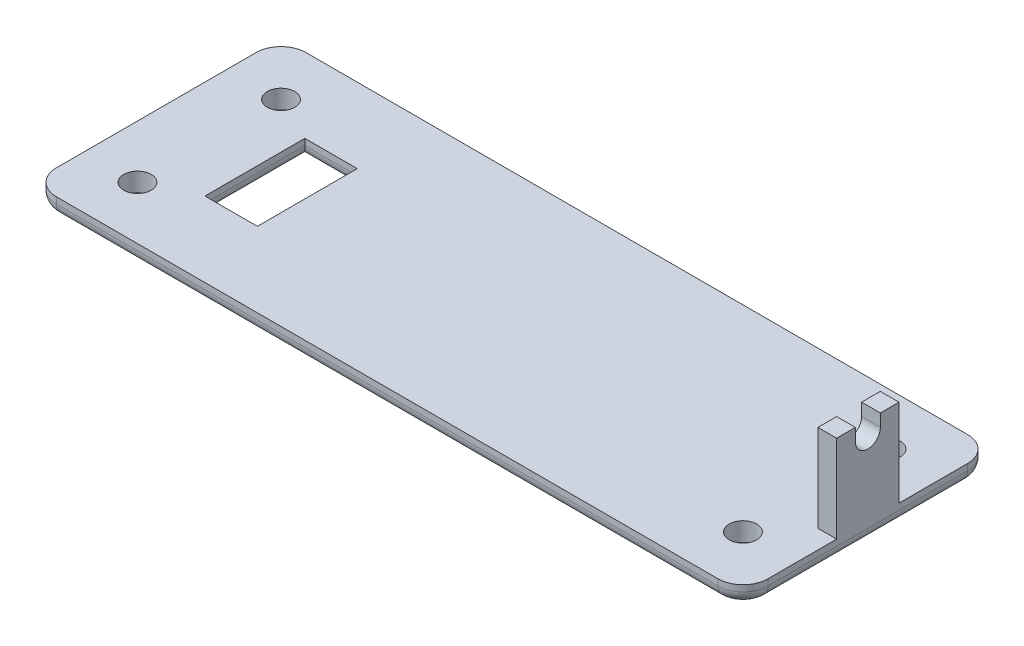
ISO-10303-21;
HEADER;
FILE_DESCRIPTION(('STEP AP214'),'2;1');
FILE_NAME('part.step','',(''),(''),'','','');
FILE_SCHEMA(('AUTOMOTIVE_DESIGN { 1 0 10303 214 1 1 1 1 }'));
ENDSEC;
DATA;
#1=APPLICATION_CONTEXT('core data for automotive mechanical design processes');
#2=APPLICATION_PROTOCOL_DEFINITION('international standard','automotive_design',2000,#1);
#3=PRODUCT_CONTEXT('',#1,'mechanical');
#4=PRODUCT('Part','Part','',(#3));
#5=PRODUCT_RELATED_PRODUCT_CATEGORY('part','',(#4));
#6=PRODUCT_DEFINITION_FORMATION('','',#4);
#7=PRODUCT_DEFINITION_CONTEXT('part definition',#1,'design');
#8=PRODUCT_DEFINITION('design','',#6,#7);
#9=PRODUCT_DEFINITION_SHAPE('','',#8);
#10=(LENGTH_UNIT() NAMED_UNIT(*) SI_UNIT(.MILLI.,.METRE.));
#11=(NAMED_UNIT(*) PLANE_ANGLE_UNIT() SI_UNIT($,.RADIAN.));
#12=(NAMED_UNIT(*) SI_UNIT($,.STERADIAN.) SOLID_ANGLE_UNIT());
#13=UNCERTAINTY_MEASURE_WITH_UNIT(LENGTH_MEASURE(1.E-05),#10,'distance_accuracy_value','');
#14=(GEOMETRIC_REPRESENTATION_CONTEXT(3) GLOBAL_UNCERTAINTY_ASSIGNED_CONTEXT((#13)) GLOBAL_UNIT_ASSIGNED_CONTEXT((#10,
#11,#12)) REPRESENTATION_CONTEXT('',''));
#15=CARTESIAN_POINT('',(0.,0.,0.));
#16=DIRECTION('',(0.,0.,1.));
#17=DIRECTION('',(1.,0.,0.));
#18=AXIS2_PLACEMENT_3D('',#15,#16,#17);
#19=CARTESIAN_POINT('',(0.,21.59,0.));
#20=DIRECTION('',(0.,-1.,0.));
#21=DIRECTION('',(0.,0.,-1.));
#22=AXIS2_PLACEMENT_3D('',#19,#20,#21);
#23=PLANE('',#22);
#24=DIRECTION('',(0.,0.,-1.));
#25=VECTOR('',#24,1.);
#26=CARTESIAN_POINT('',(72.39,21.59,-6.35000000000002));
#27=LINE('',#26,#25);
#28=CARTESIAN_POINT('',(72.39,21.59,6.34999999999998));
#29=VERTEX_POINT('',#28);
#30=CARTESIAN_POINT('',(72.39,21.59,2.54));
#31=VERTEX_POINT('',#30);
#32=EDGE_CURVE('E265',#29,#31,#27,.T.);
#33=ORIENTED_EDGE('',*,*,#32,.T.);
#34=DIRECTION('',(1.,0.,0.));
#35=VECTOR('',#34,1.);
#36=CARTESIAN_POINT('',(-72.391,21.59,2.54));
#37=LINE('',#36,#35);
#38=CARTESIAN_POINT('',(68.58,21.59,2.54));
#39=VERTEX_POINT('',#38);
#40=EDGE_CURVE('E253',#39,#31,#37,.T.);
#41=ORIENTED_EDGE('',*,*,#40,.F.);
#42=DIRECTION('',(0.,0.,1.));
#43=VECTOR('',#42,1.);
#44=CARTESIAN_POINT('',(68.58,21.59,-6.35000000000002));
#45=LINE('',#44,#43);
#46=CARTESIAN_POINT('',(68.58,21.59,6.34999999999998));
#47=VERTEX_POINT('',#46);
#48=EDGE_CURVE('E271',#39,#47,#45,.T.);
#49=ORIENTED_EDGE('',*,*,#48,.T.);
#50=DIRECTION('',(1.,0.,0.));
#51=VECTOR('',#50,1.);
#52=CARTESIAN_POINT('',(72.39,21.59,6.34999999999998));
#53=LINE('',#52,#51);
#54=EDGE_CURVE('E275',#47,#29,#53,.T.);
#55=ORIENTED_EDGE('',*,*,#54,.T.);
#56=EDGE_LOOP('',(#33,#41,#49,#55));
#57=FACE_BOUND('',#56,.T.);
#58=ADVANCED_FACE('F41',(#57),#23,.F.);
#59=CARTESIAN_POINT('',(0.,3.81,0.));
#60=DIRECTION('',(0.,-1.,0.));
#61=DIRECTION('',(0.,0.,-1.));
#62=AXIS2_PLACEMENT_3D('',#59,#60,#61);
#63=PLANE('',#62);
#64=CARTESIAN_POINT('',(-61.595,3.81,-14.605));
#65=DIRECTION('',(0.,-1.,0.));
#66=DIRECTION('',(0.,0.,-1.));
#67=AXIS2_PLACEMENT_3D('',#64,#65,#66);
#68=CIRCLE('',#67,2.794);
#69=CARTESIAN_POINT('',(-61.595,3.81,-17.399));
#70=VERTEX_POINT('',#69);
#71=EDGE_CURVE('E229',#70,#70,#68,.T.);
#72=ORIENTED_EDGE('',*,*,#71,.T.);
#73=EDGE_LOOP('',(#72));
#74=FACE_BOUND('',#73,.T.);
#75=CARTESIAN_POINT('',(-61.595,3.81,14.605));
#76=DIRECTION('',(0.,-1.,0.));
#77=DIRECTION('',(0.,0.,-1.));
#78=AXIS2_PLACEMENT_3D('',#75,#76,#77);
#79=CIRCLE('',#78,2.794);
#80=CARTESIAN_POINT('',(-61.595,3.81,11.811));
#81=VERTEX_POINT('',#80);
#82=EDGE_CURVE('E851',#81,#81,#79,.T.);
#83=ORIENTED_EDGE('',*,*,#82,.T.);
#84=EDGE_LOOP('',(#83));
#85=FACE_BOUND('',#84,.T.);
#86=CARTESIAN_POINT('',(61.595,3.81,14.605));
#87=DIRECTION('',(0.,-1.,0.));
#88=DIRECTION('',(0.,0.,-1.));
#89=AXIS2_PLACEMENT_3D('',#86,#87,#88);
#90=CIRCLE('',#89,2.79400000000001);
#91=CARTESIAN_POINT('',(61.595,3.81,11.811));
#92=VERTEX_POINT('',#91);
#93=EDGE_CURVE('E848',#92,#92,#90,.T.);
#94=ORIENTED_EDGE('',*,*,#93,.T.);
#95=EDGE_LOOP('',(#94));
#96=FACE_BOUND('',#95,.T.);
#97=CARTESIAN_POINT('',(61.595,3.81,-14.605));
#98=DIRECTION('',(0.,-1.,0.));
#99=DIRECTION('',(0.,0.,-1.));
#100=AXIS2_PLACEMENT_3D('',#97,#98,#99);
#101=CIRCLE('',#100,2.79400000000001);
#102=CARTESIAN_POINT('',(61.595,3.81,-17.399));
#103=VERTEX_POINT('',#102);
#104=EDGE_CURVE('E846',#103,#103,#101,.T.);
#105=ORIENTED_EDGE('',*,*,#104,.T.);
#106=EDGE_LOOP('',(#105));
#107=FACE_BOUND('',#106,.T.);
#108=DIRECTION('',(-1.,0.,0.));
#109=VECTOR('',#108,1.);
#110=CARTESIAN_POINT('',(0.,3.81,10.16));
#111=LINE('',#110,#109);
#112=CARTESIAN_POINT('',(-41.642,3.81,10.16));
#113=VERTEX_POINT('',#112);
#114=CARTESIAN_POINT('',(-52.31,3.81,10.16));
#115=VERTEX_POINT('',#114);
#116=EDGE_CURVE('E234',#113,#115,#111,.T.);
#117=ORIENTED_EDGE('',*,*,#116,.T.);
#118=DIRECTION('',(0.,0.,-1.));
#119=VECTOR('',#118,1.);
#120=CARTESIAN_POINT('',(-52.31,3.81,0.));
#121=LINE('',#120,#119);
#122=CARTESIAN_POINT('',(-52.31,3.81,-10.16));
#123=VERTEX_POINT('',#122);
#124=EDGE_CURVE('E227',#115,#123,#121,.T.);
#125=ORIENTED_EDGE('',*,*,#124,.T.);
#126=DIRECTION('',(1.,0.,0.));
#127=VECTOR('',#126,1.);
#128=CARTESIAN_POINT('',(0.,3.81,-10.16));
#129=LINE('',#128,#127);
#130=CARTESIAN_POINT('',(-41.642,3.81,-10.16));
#131=VERTEX_POINT('',#130);
#132=EDGE_CURVE('E215',#123,#131,#129,.T.);
#133=ORIENTED_EDGE('',*,*,#132,.T.);
#134=DIRECTION('',(0.,0.,1.));
#135=VECTOR('',#134,1.);
#136=CARTESIAN_POINT('',(-41.642,3.81,0.));
#137=LINE('',#136,#135);
#138=EDGE_CURVE('E223',#131,#113,#137,.T.);
#139=ORIENTED_EDGE('',*,*,#138,.T.);
#140=EDGE_LOOP('',(#117,#125,#133,#139));
#141=FACE_BOUND('',#140,.T.);
#142=DIRECTION('',(-1.,0.,0.));
#143=VECTOR('',#142,1.);
#144=CARTESIAN_POINT('',(-72.39,3.81,-25.4));
#145=LINE('',#144,#143);
#146=CARTESIAN_POINT('',(67.31,3.81,-25.4));
#147=VERTEX_POINT('',#146);
#148=CARTESIAN_POINT('',(-67.31,3.81,-25.4));
#149=VERTEX_POINT('',#148);
#150=EDGE_CURVE('E300',#147,#149,#145,.T.);
#151=ORIENTED_EDGE('',*,*,#150,.T.);
#152=CARTESIAN_POINT('',(-67.31,3.81,-20.32));
#153=DIRECTION('',(0.,-1.,0.));
#154=DIRECTION('',(0.,0.,-1.));
#155=AXIS2_PLACEMENT_3D('',#152,#153,#154);
#156=CIRCLE('',#155,5.08);
#157=CARTESIAN_POINT('',(-72.39,3.81,-20.32));
#158=VERTEX_POINT('',#157);
#159=EDGE_CURVE('E325',#149,#158,#156,.F.);
#160=ORIENTED_EDGE('',*,*,#159,.T.);
#161=DIRECTION('',(0.,0.,1.));
#162=VECTOR('',#161,1.);
#163=CARTESIAN_POINT('',(-72.39,3.81,25.4));
#164=LINE('',#163,#162);
#165=CARTESIAN_POINT('',(-72.39,3.81,20.32));
#166=VERTEX_POINT('',#165);
#167=EDGE_CURVE('E303',#158,#166,#164,.T.);
#168=ORIENTED_EDGE('',*,*,#167,.T.);
#169=CARTESIAN_POINT('',(-67.31,3.81,20.32));
#170=DIRECTION('',(0.,-1.,0.));
#171=DIRECTION('',(0.,0.,-1.));
#172=AXIS2_PLACEMENT_3D('',#169,#170,#171);
#173=CIRCLE('',#172,5.08);
#174=CARTESIAN_POINT('',(-67.31,3.81,25.4));
#175=VERTEX_POINT('',#174);
#176=EDGE_CURVE('E323',#166,#175,#173,.F.);
#177=ORIENTED_EDGE('',*,*,#176,.T.);
#178=DIRECTION('',(1.,0.,0.));
#179=VECTOR('',#178,1.);
#180=CARTESIAN_POINT('',(-72.39,3.81,25.4));
#181=LINE('',#180,#179);
#182=CARTESIAN_POINT('',(67.31,3.81,25.4));
#183=VERTEX_POINT('',#182);
#184=EDGE_CURVE('E306',#175,#183,#181,.T.);
#185=ORIENTED_EDGE('',*,*,#184,.T.);
#186=CARTESIAN_POINT('',(67.31,3.81,20.32));
#187=DIRECTION('',(0.,-1.,0.));
#188=DIRECTION('',(0.,0.,-1.));
#189=AXIS2_PLACEMENT_3D('',#186,#187,#188);
#190=CIRCLE('',#189,5.08);
#191=CARTESIAN_POINT('',(72.39,3.81,20.32));
#192=VERTEX_POINT('',#191);
#193=EDGE_CURVE('E321',#183,#192,#190,.F.);
#194=ORIENTED_EDGE('',*,*,#193,.T.);
#195=DIRECTION('',(0.,0.,-1.));
#196=VECTOR('',#195,1.);
#197=CARTESIAN_POINT('',(72.39,3.81,25.4));
#198=LINE('',#197,#196);
#199=CARTESIAN_POINT('',(72.39,3.81,6.34999999999998));
#200=VERTEX_POINT('',#199);
#201=EDGE_CURVE('E298',#192,#200,#198,.T.);
#202=ORIENTED_EDGE('',*,*,#201,.T.);
#203=DIRECTION('',(1.,0.,0.));
#204=VECTOR('',#203,1.);
#205=CARTESIAN_POINT('',(72.39,3.81,6.34999999999998));
#206=LINE('',#205,#204);
#207=CARTESIAN_POINT('',(68.58,3.81,6.34999999999998));
#208=VERTEX_POINT('',#207);
#209=EDGE_CURVE('E283',#208,#200,#206,.T.);
#210=ORIENTED_EDGE('',*,*,#209,.F.);
#211=DIRECTION('',(0.,0.,1.));
#212=VECTOR('',#211,1.);
#213=CARTESIAN_POINT('',(68.58,3.81,-6.35000000000002));
#214=LINE('',#213,#212);
#215=CARTESIAN_POINT('',(68.58,3.81,-6.35000000000002));
#216=VERTEX_POINT('',#215);
#217=EDGE_CURVE('E280',#216,#208,#214,.T.);
#218=ORIENTED_EDGE('',*,*,#217,.F.);
#219=DIRECTION('',(-1.,0.,0.));
#220=VECTOR('',#219,1.);
#221=CARTESIAN_POINT('',(72.39,3.81,-6.35000000000002));
#222=LINE('',#221,#220);
#223=CARTESIAN_POINT('',(72.39,3.81,-6.35000000000002));
#224=VERTEX_POINT('',#223);
#225=EDGE_CURVE('E264',#224,#216,#222,.T.);
#226=ORIENTED_EDGE('',*,*,#225,.F.);
#227=CARTESIAN_POINT('',(72.39,3.81,-20.32));
#228=VERTEX_POINT('',#227);
#229=EDGE_CURVE('E297',#224,#228,#198,.T.);
#230=ORIENTED_EDGE('',*,*,#229,.T.);
#231=CARTESIAN_POINT('',(67.31,3.81,-20.32));
#232=DIRECTION('',(0.,-1.,0.));
#233=DIRECTION('',(0.,0.,-1.));
#234=AXIS2_PLACEMENT_3D('',#231,#232,#233);
#235=CIRCLE('',#234,5.08);
#236=EDGE_CURVE('E319',#228,#147,#235,.F.);
#237=ORIENTED_EDGE('',*,*,#236,.T.);
#238=EDGE_LOOP('',(#151,#160,#168,#177,#185,#194,#202,#210,#218,#226,#230,#237));
#239=FACE_BOUND('',#238,.T.);
#240=ADVANCED_FACE('F232',(#74,#85,#96,#107,#141,#239),#63,.F.);
#241=CARTESIAN_POINT('',(72.39,3.81,25.4));
#242=DIRECTION('',(-1.,0.,0.));
#243=DIRECTION('',(0.,0.,1.));
#244=AXIS2_PLACEMENT_3D('',#241,#242,#243);
#245=PLANE('',#244);
#246=DIRECTION('',(0.,-1.,0.));
#247=VECTOR('',#246,1.);
#248=CARTESIAN_POINT('',(72.39,3.81,20.32));
#249=LINE('',#248,#247);
#250=CARTESIAN_POINT('',(72.39,2.54,20.32));
#251=VERTEX_POINT('',#250);
#252=EDGE_CURVE('E334',#192,#251,#249,.T.);
#253=ORIENTED_EDGE('',*,*,#252,.T.);
#254=DIRECTION('',(0.,0.,-1.));
#255=VECTOR('',#254,1.);
#256=CARTESIAN_POINT('',(72.39,2.54,-20.32));
#257=LINE('',#256,#255);
#258=CARTESIAN_POINT('',(72.39,2.54,-20.32));
#259=VERTEX_POINT('',#258);
#260=EDGE_CURVE('E372',#251,#259,#257,.T.);
#261=ORIENTED_EDGE('',*,*,#260,.T.);
#262=DIRECTION('',(0.,-1.,0.));
#263=VECTOR('',#262,1.);
#264=CARTESIAN_POINT('',(72.39,3.81,-20.32));
#265=LINE('',#264,#263);
#266=EDGE_CURVE('E332',#259,#228,#265,.F.);
#267=ORIENTED_EDGE('',*,*,#266,.T.);
#268=ORIENTED_EDGE('',*,*,#229,.F.);
#269=DIRECTION('',(0.,-1.,0.));
#270=VECTOR('',#269,1.);
#271=CARTESIAN_POINT('',(72.39,21.59,-6.35000000000002));
#272=LINE('',#271,#270);
#273=CARTESIAN_POINT('',(72.39,21.59,-6.35000000000002));
#274=VERTEX_POINT('',#273);
#275=EDGE_CURVE('E294',#274,#224,#272,.T.);
#276=ORIENTED_EDGE('',*,*,#275,.F.);
#277=CARTESIAN_POINT('',(72.39,21.59,-2.54));
#278=VERTEX_POINT('',#277);
#279=EDGE_CURVE('E269',#278,#274,#27,.T.);
#280=ORIENTED_EDGE('',*,*,#279,.F.);
#281=DIRECTION('',(0.,1.,0.));
#282=VECTOR('',#281,1.);
#283=CARTESIAN_POINT('',(72.39,21.59,-2.54));
#284=LINE('',#283,#282);
#285=CARTESIAN_POINT('',(72.39,19.05,-2.54));
#286=VERTEX_POINT('',#285);
#287=EDGE_CURVE('E250',#286,#278,#284,.T.);
#288=ORIENTED_EDGE('',*,*,#287,.F.);
#289=CARTESIAN_POINT('',(72.39,19.05,0.));
#290=DIRECTION('',(1.,0.,0.));
#291=DIRECTION('',(0.,0.,1.));
#292=AXIS2_PLACEMENT_3D('',#289,#290,#291);
#293=CIRCLE('',#292,2.54);
#294=CARTESIAN_POINT('',(72.39,19.05,2.54));
#295=VERTEX_POINT('',#294);
#296=EDGE_CURVE('E247',#295,#286,#293,.T.);
#297=ORIENTED_EDGE('',*,*,#296,.F.);
#298=DIRECTION('',(0.,-1.,0.));
#299=VECTOR('',#298,1.);
#300=CARTESIAN_POINT('',(72.39,21.59,2.54));
#301=LINE('',#300,#299);
#302=EDGE_CURVE('E244',#31,#295,#301,.T.);
#303=ORIENTED_EDGE('',*,*,#302,.F.);
#304=ORIENTED_EDGE('',*,*,#32,.F.);
#305=DIRECTION('',(0.,-1.,0.));
#306=VECTOR('',#305,1.);
#307=CARTESIAN_POINT('',(72.39,21.59,6.34999999999998));
#308=LINE('',#307,#306);
#309=EDGE_CURVE('E277',#29,#200,#308,.T.);
#310=ORIENTED_EDGE('',*,*,#309,.T.);
#311=ORIENTED_EDGE('',*,*,#201,.F.);
#312=EDGE_LOOP('',(#253,#261,#267,#268,#276,#280,#288,#297,#303,#304,#310,#311));
#313=FACE_BOUND('',#312,.T.);
#314=ADVANCED_FACE('F463',(#313),#245,.F.);
#315=CARTESIAN_POINT('',(-72.39,3.81,-25.4));
#316=DIRECTION('',(0.,0.,1.));
#317=DIRECTION('',(1.,0.,0.));
#318=AXIS2_PLACEMENT_3D('',#315,#316,#317);
#319=PLANE('',#318);
#320=DIRECTION('',(0.,-1.,0.));
#321=VECTOR('',#320,1.);
#322=CARTESIAN_POINT('',(67.31,3.81,-25.4));
#323=LINE('',#322,#321);
#324=CARTESIAN_POINT('',(67.31,2.54,-25.4));
#325=VERTEX_POINT('',#324);
#326=EDGE_CURVE('E314',#147,#325,#323,.T.);
#327=ORIENTED_EDGE('',*,*,#326,.T.);
#328=DIRECTION('',(-1.,0.,0.));
#329=VECTOR('',#328,1.);
#330=CARTESIAN_POINT('',(-67.31,2.54,-25.4));
#331=LINE('',#330,#329);
#332=CARTESIAN_POINT('',(-67.31,2.54,-25.4));
#333=VERTEX_POINT('',#332);
#334=EDGE_CURVE('E376',#325,#333,#331,.T.);
#335=ORIENTED_EDGE('',*,*,#334,.T.);
#336=DIRECTION('',(0.,-1.,0.));
#337=VECTOR('',#336,1.);
#338=CARTESIAN_POINT('',(-67.31,3.81,-25.4));
#339=LINE('',#338,#337);
#340=EDGE_CURVE('E317',#333,#149,#339,.F.);
#341=ORIENTED_EDGE('',*,*,#340,.T.);
#342=ORIENTED_EDGE('',*,*,#150,.F.);
#343=EDGE_LOOP('',(#327,#335,#341,#342));
#344=FACE_BOUND('',#343,.T.);
#345=ADVANCED_FACE('F523',(#344),#319,.F.);
#346=CARTESIAN_POINT('',(-72.39,3.81,25.4));
#347=DIRECTION('',(1.,0.,0.));
#348=DIRECTION('',(0.,0.,-1.));
#349=AXIS2_PLACEMENT_3D('',#346,#347,#348);
#350=PLANE('',#349);
#351=DIRECTION('',(0.,-1.,0.));
#352=VECTOR('',#351,1.);
#353=CARTESIAN_POINT('',(-72.39,3.81,-20.32));
#354=LINE('',#353,#352);
#355=CARTESIAN_POINT('',(-72.39,2.54,-20.32));
#356=VERTEX_POINT('',#355);
#357=EDGE_CURVE('E311',#158,#356,#354,.T.);
#358=ORIENTED_EDGE('',*,*,#357,.T.);
#359=DIRECTION('',(0.,0.,1.));
#360=VECTOR('',#359,1.);
#361=CARTESIAN_POINT('',(-72.39,2.54,20.32));
#362=LINE('',#361,#360);
#363=CARTESIAN_POINT('',(-72.39,2.54,20.32));
#364=VERTEX_POINT('',#363);
#365=EDGE_CURVE('E337',#356,#364,#362,.T.);
#366=ORIENTED_EDGE('',*,*,#365,.T.);
#367=DIRECTION('',(0.,-1.,0.));
#368=VECTOR('',#367,1.);
#369=CARTESIAN_POINT('',(-72.39,3.81,20.32));
#370=LINE('',#369,#368);
#371=EDGE_CURVE('E309',#364,#166,#370,.F.);
#372=ORIENTED_EDGE('',*,*,#371,.T.);
#373=ORIENTED_EDGE('',*,*,#167,.F.);
#374=EDGE_LOOP('',(#358,#366,#372,#373));
#375=FACE_BOUND('',#374,.T.);
#376=ADVANCED_FACE('F532',(#375),#350,.F.);
#377=CARTESIAN_POINT('',(-72.39,3.81,25.4));
#378=DIRECTION('',(0.,0.,-1.));
#379=DIRECTION('',(-1.,0.,0.));
#380=AXIS2_PLACEMENT_3D('',#377,#378,#379);
#381=PLANE('',#380);
#382=DIRECTION('',(0.,-1.,0.));
#383=VECTOR('',#382,1.);
#384=CARTESIAN_POINT('',(-67.31,3.81,25.4));
#385=LINE('',#384,#383);
#386=CARTESIAN_POINT('',(-67.31,2.54,25.4));
#387=VERTEX_POINT('',#386);
#388=EDGE_CURVE('E329',#175,#387,#385,.T.);
#389=ORIENTED_EDGE('',*,*,#388,.T.);
#390=DIRECTION('',(1.,0.,0.));
#391=VECTOR('',#390,1.);
#392=CARTESIAN_POINT('',(67.31,2.54,25.4));
#393=LINE('',#392,#391);
#394=CARTESIAN_POINT('',(67.31,2.54,25.4));
#395=VERTEX_POINT('',#394);
#396=EDGE_CURVE('E368',#387,#395,#393,.T.);
#397=ORIENTED_EDGE('',*,*,#396,.T.);
#398=DIRECTION('',(0.,-1.,0.));
#399=VECTOR('',#398,1.);
#400=CARTESIAN_POINT('',(67.31,3.81,25.4));
#401=LINE('',#400,#399);
#402=EDGE_CURVE('E327',#395,#183,#401,.F.);
#403=ORIENTED_EDGE('',*,*,#402,.T.);
#404=ORIENTED_EDGE('',*,*,#184,.F.);
#405=EDGE_LOOP('',(#389,#397,#403,#404));
#406=FACE_BOUND('',#405,.T.);
#407=ADVANCED_FACE('F543',(#406),#381,.F.);
#408=CARTESIAN_POINT('',(0.,0.,0.));
#409=DIRECTION('',(0.,-1.,0.));
#410=DIRECTION('',(0.,0.,-1.));
#411=AXIS2_PLACEMENT_3D('',#408,#409,#410);
#412=PLANE('',#411);
#413=DIRECTION('',(0.,0.,-1.));
#414=VECTOR('',#413,1.);
#415=CARTESIAN_POINT('',(-54.85,0.,10.16));
#416=LINE('',#415,#414);
#417=CARTESIAN_POINT('',(-54.85,0.,-12.7));
#418=VERTEX_POINT('',#417);
#419=CARTESIAN_POINT('',(-54.85,0.,12.7));
#420=VERTEX_POINT('',#419);
#421=EDGE_CURVE('E361',#418,#420,#416,.F.);
#422=ORIENTED_EDGE('',*,*,#421,.T.);
#423=DIRECTION('',(-1.,0.,0.));
#424=VECTOR('',#423,1.);
#425=CARTESIAN_POINT('',(-41.642,0.,12.7));
#426=LINE('',#425,#424);
#427=CARTESIAN_POINT('',(-39.102,0.,12.7));
#428=VERTEX_POINT('',#427);
#429=EDGE_CURVE('E363',#420,#428,#426,.F.);
#430=ORIENTED_EDGE('',*,*,#429,.T.);
#431=DIRECTION('',(0.,0.,1.));
#432=VECTOR('',#431,1.);
#433=CARTESIAN_POINT('',(-39.102,0.,-10.16));
#434=LINE('',#433,#432);
#435=CARTESIAN_POINT('',(-39.102,0.,-12.7));
#436=VERTEX_POINT('',#435);
#437=EDGE_CURVE('E357',#428,#436,#434,.F.);
#438=ORIENTED_EDGE('',*,*,#437,.T.);
#439=DIRECTION('',(1.,0.,0.));
#440=VECTOR('',#439,1.);
#441=CARTESIAN_POINT('',(-52.31,0.,-12.7));
#442=LINE('',#441,#440);
#443=EDGE_CURVE('E359',#436,#418,#442,.F.);
#444=ORIENTED_EDGE('',*,*,#443,.T.);
#445=EDGE_LOOP('',(#422,#430,#438,#444));
#446=FACE_BOUND('',#445,.T.);
#447=CARTESIAN_POINT('',(-67.31,0.,20.32));
#448=DIRECTION('',(0.,-1.,0.));
#449=DIRECTION('',(0.,0.,-1.));
#450=AXIS2_PLACEMENT_3D('',#447,#448,#449);
#451=CIRCLE('',#450,2.54);
#452=CARTESIAN_POINT('',(-67.31,0.,22.86));
#453=VERTEX_POINT('',#452);
#454=CARTESIAN_POINT('',(-69.85,0.,20.32));
#455=VERTEX_POINT('',#454);
#456=EDGE_CURVE('E352',#453,#455,#451,.T.);
#457=ORIENTED_EDGE('',*,*,#456,.T.);
#458=DIRECTION('',(0.,0.,1.));
#459=VECTOR('',#458,1.);
#460=CARTESIAN_POINT('',(-69.85,0.,-20.32));
#461=LINE('',#460,#459);
#462=CARTESIAN_POINT('',(-69.85,0.,-20.32));
#463=VERTEX_POINT('',#462);
#464=EDGE_CURVE('E354',#455,#463,#461,.F.);
#465=ORIENTED_EDGE('',*,*,#464,.T.);
#466=CARTESIAN_POINT('',(-67.31,0.,-20.32));
#467=DIRECTION('',(0.,-1.,0.));
#468=DIRECTION('',(0.,0.,-1.));
#469=AXIS2_PLACEMENT_3D('',#466,#467,#468);
#470=CIRCLE('',#469,2.54);
#471=CARTESIAN_POINT('',(-67.31,0.,-22.86));
#472=VERTEX_POINT('',#471);
#473=EDGE_CURVE('E340',#463,#472,#470,.T.);
#474=ORIENTED_EDGE('',*,*,#473,.T.);
#475=DIRECTION('',(-1.,0.,0.));
#476=VECTOR('',#475,1.);
#477=CARTESIAN_POINT('',(67.31,0.,-22.86));
#478=LINE('',#477,#476);
#479=CARTESIAN_POINT('',(67.31,0.,-22.86));
#480=VERTEX_POINT('',#479);
#481=EDGE_CURVE('E342',#472,#480,#478,.F.);
#482=ORIENTED_EDGE('',*,*,#481,.T.);
#483=CARTESIAN_POINT('',(67.31,0.,-20.32));
#484=DIRECTION('',(0.,-1.,0.));
#485=DIRECTION('',(0.,0.,-1.));
#486=AXIS2_PLACEMENT_3D('',#483,#484,#485);
#487=CIRCLE('',#486,2.54);
#488=CARTESIAN_POINT('',(69.85,0.,-20.32));
#489=VERTEX_POINT('',#488);
#490=EDGE_CURVE('E344',#480,#489,#487,.T.);
#491=ORIENTED_EDGE('',*,*,#490,.T.);
#492=DIRECTION('',(0.,0.,-1.));
#493=VECTOR('',#492,1.);
#494=CARTESIAN_POINT('',(69.85,0.,20.32));
#495=LINE('',#494,#493);
#496=CARTESIAN_POINT('',(69.85,0.,20.32));
#497=VERTEX_POINT('',#496);
#498=EDGE_CURVE('E346',#489,#497,#495,.F.);
#499=ORIENTED_EDGE('',*,*,#498,.T.);
#500=CARTESIAN_POINT('',(67.31,0.,20.32));
#501=DIRECTION('',(0.,-1.,0.));
#502=DIRECTION('',(0.,0.,-1.));
#503=AXIS2_PLACEMENT_3D('',#500,#501,#502);
#504=CIRCLE('',#503,2.54);
#505=CARTESIAN_POINT('',(67.31,0.,22.86));
#506=VERTEX_POINT('',#505);
#507=EDGE_CURVE('E348',#497,#506,#504,.T.);
#508=ORIENTED_EDGE('',*,*,#507,.T.);
#509=DIRECTION('',(1.,0.,0.));
#510=VECTOR('',#509,1.);
#511=CARTESIAN_POINT('',(-67.31,0.,22.86));
#512=LINE('',#511,#510);
#513=EDGE_CURVE('E350',#506,#453,#512,.F.);
#514=ORIENTED_EDGE('',*,*,#513,.T.);
#515=EDGE_LOOP('',(#457,#465,#474,#482,#491,#499,#508,#514));
#516=FACE_BOUND('',#515,.T.);
#517=CARTESIAN_POINT('',(-61.595,0.,-14.605));
#518=DIRECTION('',(0.,-1.,0.));
#519=DIRECTION('',(0.,0.,1.));
#520=AXIS2_PLACEMENT_3D('',#517,#518,#519);
#521=CIRCLE('',#520,2.794);
#522=CARTESIAN_POINT('',(-61.595,0.,-11.811));
#523=VERTEX_POINT('',#522);
#524=EDGE_CURVE('E406',#523,#523,#521,.T.);
#525=ORIENTED_EDGE('',*,*,#524,.F.);
#526=EDGE_LOOP('',(#525));
#527=FACE_BOUND('',#526,.T.);
#528=CARTESIAN_POINT('',(-61.595,0.,14.605));
#529=DIRECTION('',(0.,-1.,0.));
#530=DIRECTION('',(0.,0.,-1.));
#531=AXIS2_PLACEMENT_3D('',#528,#529,#530);
#532=CIRCLE('',#531,2.794);
#533=CARTESIAN_POINT('',(-61.595,0.,11.811));
#534=VERTEX_POINT('',#533);
#535=EDGE_CURVE('E868',#534,#534,#532,.T.);
#536=ORIENTED_EDGE('',*,*,#535,.F.);
#537=EDGE_LOOP('',(#536));
#538=FACE_BOUND('',#537,.T.);
#539=CARTESIAN_POINT('',(61.595,0.,14.605));
#540=DIRECTION('',(0.,-1.,0.));
#541=DIRECTION('',(0.,0.,1.));
#542=AXIS2_PLACEMENT_3D('',#539,#540,#541);
#543=CIRCLE('',#542,2.79400000000001);
#544=CARTESIAN_POINT('',(61.595,0.,17.399));
#545=VERTEX_POINT('',#544);
#546=EDGE_CURVE('E853',#545,#545,#543,.T.);
#547=ORIENTED_EDGE('',*,*,#546,.F.);
#548=EDGE_LOOP('',(#547));
#549=FACE_BOUND('',#548,.T.);
#550=CARTESIAN_POINT('',(61.595,0.,-14.605));
#551=DIRECTION('',(0.,-1.,0.));
#552=DIRECTION('',(0.,0.,-1.));
#553=AXIS2_PLACEMENT_3D('',#550,#551,#552);
#554=CIRCLE('',#553,2.79400000000001);
#555=CARTESIAN_POINT('',(61.595,0.,-17.399));
#556=VERTEX_POINT('',#555);
#557=EDGE_CURVE('E843',#556,#556,#554,.T.);
#558=ORIENTED_EDGE('',*,*,#557,.F.);
#559=EDGE_LOOP('',(#558));
#560=FACE_BOUND('',#559,.T.);
#561=ADVANCED_FACE('F425',(#446,#516,#527,#538,#549,#560),#412,.T.);
#562=CARTESIAN_POINT('',(72.39,21.59,-6.35000000000002));
#563=DIRECTION('',(0.,0.,1.));
#564=DIRECTION('',(1.,0.,0.));
#565=AXIS2_PLACEMENT_3D('',#562,#563,#564);
#566=PLANE('',#565);
#567=ORIENTED_EDGE('',*,*,#225,.T.);
#568=DIRECTION('',(0.,-1.,0.));
#569=VECTOR('',#568,1.);
#570=CARTESIAN_POINT('',(68.58,21.59,-6.35000000000002));
#571=LINE('',#570,#569);
#572=CARTESIAN_POINT('',(68.58,21.59,-6.35000000000002));
#573=VERTEX_POINT('',#572);
#574=EDGE_CURVE('E291',#573,#216,#571,.T.);
#575=ORIENTED_EDGE('',*,*,#574,.F.);
#576=DIRECTION('',(-1.,0.,0.));
#577=VECTOR('',#576,1.);
#578=CARTESIAN_POINT('',(72.39,21.59,-6.35000000000002));
#579=LINE('',#578,#577);
#580=EDGE_CURVE('E268',#274,#573,#579,.T.);
#581=ORIENTED_EDGE('',*,*,#580,.F.);
#582=ORIENTED_EDGE('',*,*,#275,.T.);
#583=EDGE_LOOP('',(#567,#575,#581,#582));
#584=FACE_BOUND('',#583,.T.);
#585=ADVANCED_FACE('F497',(#584),#566,.F.);
#586=CARTESIAN_POINT('',(68.58,21.59,-6.35000000000002));
#587=DIRECTION('',(1.,0.,0.));
#588=DIRECTION('',(0.,0.,-1.));
#589=AXIS2_PLACEMENT_3D('',#586,#587,#588);
#590=PLANE('',#589);
#591=ORIENTED_EDGE('',*,*,#48,.F.);
#592=DIRECTION('',(0.,1.,0.));
#593=VECTOR('',#592,1.);
#594=CARTESIAN_POINT('',(68.58,21.59,2.54));
#595=LINE('',#594,#593);
#596=CARTESIAN_POINT('',(68.58,19.05,2.54));
#597=VERTEX_POINT('',#596);
#598=EDGE_CURVE('E238',#597,#39,#595,.T.);
#599=ORIENTED_EDGE('',*,*,#598,.F.);
#600=CARTESIAN_POINT('',(68.58,19.05,0.));
#601=DIRECTION('',(1.,0.,0.));
#602=DIRECTION('',(0.,0.,-1.));
#603=AXIS2_PLACEMENT_3D('',#600,#601,#602);
#604=CIRCLE('',#603,2.54);
#605=CARTESIAN_POINT('',(68.58,19.05,-2.54));
#606=VERTEX_POINT('',#605);
#607=EDGE_CURVE('E255',#606,#597,#604,.F.);
#608=ORIENTED_EDGE('',*,*,#607,.F.);
#609=DIRECTION('',(0.,-1.,0.));
#610=VECTOR('',#609,1.);
#611=CARTESIAN_POINT('',(68.58,21.59,-2.54));
#612=LINE('',#611,#610);
#613=CARTESIAN_POINT('',(68.58,21.59,-2.54));
#614=VERTEX_POINT('',#613);
#615=EDGE_CURVE('E235',#614,#606,#612,.T.);
#616=ORIENTED_EDGE('',*,*,#615,.F.);
#617=EDGE_CURVE('E272',#573,#614,#45,.T.);
#618=ORIENTED_EDGE('',*,*,#617,.F.);
#619=ORIENTED_EDGE('',*,*,#574,.T.);
#620=ORIENTED_EDGE('',*,*,#217,.T.);
#621=DIRECTION('',(0.,-1.,0.));
#622=VECTOR('',#621,1.);
#623=CARTESIAN_POINT('',(68.58,21.59,6.34999999999998));
#624=LINE('',#623,#622);
#625=EDGE_CURVE('E288',#47,#208,#624,.T.);
#626=ORIENTED_EDGE('',*,*,#625,.F.);
#627=EDGE_LOOP('',(#591,#599,#608,#616,#618,#619,#620,#626));
#628=FACE_BOUND('',#627,.T.);
#629=ADVANCED_FACE('F478',(#628),#590,.F.);
#630=CARTESIAN_POINT('',(72.39,21.59,6.34999999999998));
#631=DIRECTION('',(0.,0.,-1.));
#632=DIRECTION('',(-1.,0.,0.));
#633=AXIS2_PLACEMENT_3D('',#630,#631,#632);
#634=PLANE('',#633);
#635=ORIENTED_EDGE('',*,*,#209,.T.);
#636=ORIENTED_EDGE('',*,*,#309,.F.);
#637=ORIENTED_EDGE('',*,*,#54,.F.);
#638=ORIENTED_EDGE('',*,*,#625,.T.);
#639=EDGE_LOOP('',(#635,#636,#637,#638));
#640=FACE_BOUND('',#639,.T.);
#641=ADVANCED_FACE('F470',(#640),#634,.F.);
#642=ORIENTED_EDGE('',*,*,#617,.T.);
#643=DIRECTION('',(1.,0.,0.));
#644=VECTOR('',#643,1.);
#645=CARTESIAN_POINT('',(-72.391,21.59,-2.54));
#646=LINE('',#645,#644);
#647=EDGE_CURVE('E256',#614,#278,#646,.T.);
#648=ORIENTED_EDGE('',*,*,#647,.T.);
#649=ORIENTED_EDGE('',*,*,#279,.T.);
#650=ORIENTED_EDGE('',*,*,#580,.T.);
#651=EDGE_LOOP('',(#642,#648,#649,#650));
#652=FACE_BOUND('',#651,.T.);
#653=ADVANCED_FACE('F457',(#652),#23,.F.);
#654=CARTESIAN_POINT('',(-72.391,21.59,2.54));
#655=DIRECTION('',(0.,0.,1.));
#656=DIRECTION('',(0.,-1.,0.));
#657=AXIS2_PLACEMENT_3D('',#654,#655,#656);
#658=PLANE('',#657);
#659=ORIENTED_EDGE('',*,*,#598,.T.);
#660=ORIENTED_EDGE('',*,*,#40,.T.);
#661=ORIENTED_EDGE('',*,*,#302,.T.);
#662=DIRECTION('',(1.,0.,0.));
#663=VECTOR('',#662,1.);
#664=CARTESIAN_POINT('',(-72.391,19.05,2.54));
#665=LINE('',#664,#663);
#666=EDGE_CURVE('E252',#597,#295,#665,.T.);
#667=ORIENTED_EDGE('',*,*,#666,.F.);
#668=EDGE_LOOP('',(#659,#660,#661,#667));
#669=FACE_BOUND('',#668,.T.);
#670=ADVANCED_FACE('F469',(#669),#658,.F.);
#671=CARTESIAN_POINT('',(-72.391,21.59,-2.54));
#672=DIRECTION('',(0.,0.,-1.));
#673=DIRECTION('',(-1.,0.,0.));
#674=AXIS2_PLACEMENT_3D('',#671,#672,#673);
#675=PLANE('',#674);
#676=ORIENTED_EDGE('',*,*,#615,.T.);
#677=DIRECTION('',(1.,0.,0.));
#678=VECTOR('',#677,1.);
#679=CARTESIAN_POINT('',(-72.391,19.05,-2.54));
#680=LINE('',#679,#678);
#681=EDGE_CURVE('E259',#606,#286,#680,.T.);
#682=ORIENTED_EDGE('',*,*,#681,.T.);
#683=ORIENTED_EDGE('',*,*,#287,.T.);
#684=ORIENTED_EDGE('',*,*,#647,.F.);
#685=EDGE_LOOP('',(#676,#682,#683,#684));
#686=FACE_BOUND('',#685,.T.);
#687=ADVANCED_FACE('F476',(#686),#675,.F.);
#688=CARTESIAN_POINT('',(-72.391,19.05,0.));
#689=DIRECTION('',(1.,0.,0.));
#690=DIRECTION('',(0.,0.,-1.));
#691=AXIS2_PLACEMENT_3D('',#688,#689,#690);
#692=CYLINDRICAL_SURFACE('',#691,2.54);
#693=ORIENTED_EDGE('',*,*,#607,.T.);
#694=ORIENTED_EDGE('',*,*,#666,.T.);
#695=ORIENTED_EDGE('',*,*,#296,.T.);
#696=ORIENTED_EDGE('',*,*,#681,.F.);
#697=EDGE_LOOP('',(#693,#694,#695,#696));
#698=FACE_BOUND('',#697,.T.);
#699=ADVANCED_FACE('F707',(#698),#692,.F.);
#700=CARTESIAN_POINT('',(-52.31,21.59,-10.16));
#701=DIRECTION('',(-1.,0.,0.));
#702=DIRECTION('',(0.,0.,1.));
#703=AXIS2_PLACEMENT_3D('',#700,#701,#702);
#704=PLANE('',#703);
#705=DIRECTION('',(0.,-1.,0.));
#706=VECTOR('',#705,1.);
#707=CARTESIAN_POINT('',(-52.31,21.59,10.16));
#708=LINE('',#707,#706);
#709=CARTESIAN_POINT('',(-52.31,2.54,10.16));
#710=VERTEX_POINT('',#709);
#711=EDGE_CURVE('E224',#115,#710,#708,.T.);
#712=ORIENTED_EDGE('',*,*,#711,.T.);
#713=DIRECTION('',(0.,0.,-1.));
#714=VECTOR('',#713,1.);
#715=CARTESIAN_POINT('',(-52.31,2.54,-10.16));
#716=LINE('',#715,#714);
#717=CARTESIAN_POINT('',(-52.31,2.54,-10.16));
#718=VERTEX_POINT('',#717);
#719=EDGE_CURVE('E66',#710,#718,#716,.T.);
#720=ORIENTED_EDGE('',*,*,#719,.T.);
#721=DIRECTION('',(0.,-1.,0.));
#722=VECTOR('',#721,1.);
#723=CARTESIAN_POINT('',(-52.31,21.59,-10.16));
#724=LINE('',#723,#722);
#725=EDGE_CURVE('E217',#123,#718,#724,.T.);
#726=ORIENTED_EDGE('',*,*,#725,.F.);
#727=ORIENTED_EDGE('',*,*,#124,.F.);
#728=EDGE_LOOP('',(#712,#720,#726,#727));
#729=FACE_BOUND('',#728,.T.);
#730=ADVANCED_FACE('F226',(#729),#704,.F.);
#731=CARTESIAN_POINT('',(-41.642,21.59,10.16));
#732=DIRECTION('',(0.,0.,1.));
#733=DIRECTION('',(1.,0.,0.));
#734=AXIS2_PLACEMENT_3D('',#731,#732,#733);
#735=PLANE('',#734);
#736=DIRECTION('',(0.,-1.,0.));
#737=VECTOR('',#736,1.);
#738=CARTESIAN_POINT('',(-41.642,21.59,10.16));
#739=LINE('',#738,#737);
#740=CARTESIAN_POINT('',(-41.642,2.54,10.16));
#741=VERTEX_POINT('',#740);
#742=EDGE_CURVE('E437',#113,#741,#739,.T.);
#743=ORIENTED_EDGE('',*,*,#742,.T.);
#744=DIRECTION('',(-1.,0.,0.));
#745=VECTOR('',#744,1.);
#746=CARTESIAN_POINT('',(-52.31,2.54,10.16));
#747=LINE('',#746,#745);
#748=EDGE_CURVE('E378',#741,#710,#747,.T.);
#749=ORIENTED_EDGE('',*,*,#748,.T.);
#750=ORIENTED_EDGE('',*,*,#711,.F.);
#751=ORIENTED_EDGE('',*,*,#116,.F.);
#752=EDGE_LOOP('',(#743,#749,#750,#751));
#753=FACE_BOUND('',#752,.T.);
#754=ADVANCED_FACE('F435',(#753),#735,.F.);
#755=CARTESIAN_POINT('',(-41.642,21.59,-10.16));
#756=DIRECTION('',(1.,0.,0.));
#757=DIRECTION('',(0.,0.,-1.));
#758=AXIS2_PLACEMENT_3D('',#755,#756,#757);
#759=PLANE('',#758);
#760=DIRECTION('',(0.,-1.,0.));
#761=VECTOR('',#760,1.);
#762=CARTESIAN_POINT('',(-41.642,21.59,-10.16));
#763=LINE('',#762,#761);
#764=CARTESIAN_POINT('',(-41.642,2.54,-10.16));
#765=VERTEX_POINT('',#764);
#766=EDGE_CURVE('E218',#131,#765,#763,.T.);
#767=ORIENTED_EDGE('',*,*,#766,.T.);
#768=DIRECTION('',(0.,0.,1.));
#769=VECTOR('',#768,1.);
#770=CARTESIAN_POINT('',(-41.642,2.54,10.16));
#771=LINE('',#770,#769);
#772=EDGE_CURVE('E50',#765,#741,#771,.T.);
#773=ORIENTED_EDGE('',*,*,#772,.T.);
#774=ORIENTED_EDGE('',*,*,#742,.F.);
#775=ORIENTED_EDGE('',*,*,#138,.F.);
#776=EDGE_LOOP('',(#767,#773,#774,#775));
#777=FACE_BOUND('',#776,.T.);
#778=ADVANCED_FACE('F444',(#777),#759,.F.);
#779=CARTESIAN_POINT('',(-41.642,21.59,-10.16));
#780=DIRECTION('',(0.,0.,-1.));
#781=DIRECTION('',(-1.,0.,0.));
#782=AXIS2_PLACEMENT_3D('',#779,#780,#781);
#783=PLANE('',#782);
#784=ORIENTED_EDGE('',*,*,#725,.T.);
#785=DIRECTION('',(1.,0.,0.));
#786=VECTOR('',#785,1.);
#787=CARTESIAN_POINT('',(-41.642,2.54,-10.16));
#788=LINE('',#787,#786);
#789=EDGE_CURVE('E58',#718,#765,#788,.T.);
#790=ORIENTED_EDGE('',*,*,#789,.T.);
#791=ORIENTED_EDGE('',*,*,#766,.F.);
#792=ORIENTED_EDGE('',*,*,#132,.F.);
#793=EDGE_LOOP('',(#784,#790,#791,#792));
#794=FACE_BOUND('',#793,.T.);
#795=ADVANCED_FACE('F216',(#794),#783,.F.);
#796=CARTESIAN_POINT('',(61.595,21.59,-14.605));
#797=DIRECTION('',(0.,-1.,0.));
#798=DIRECTION('',(0.,0.,-1.));
#799=AXIS2_PLACEMENT_3D('',#796,#797,#798);
#800=CYLINDRICAL_SURFACE('',#799,2.79400000000001);
#801=ORIENTED_EDGE('',*,*,#557,.T.);
#802=EDGE_LOOP('',(#801));
#803=FACE_BOUND('',#802,.T.);
#804=ORIENTED_EDGE('',*,*,#104,.F.);
#805=EDGE_LOOP('',(#804));
#806=FACE_BOUND('',#805,.T.);
#807=ADVANCED_FACE('F451',(#803,#806),#800,.F.);
#808=CARTESIAN_POINT('',(61.595,21.59,14.605));
#809=DIRECTION('',(0.,-1.,0.));
#810=DIRECTION('',(0.,0.,-1.));
#811=AXIS2_PLACEMENT_3D('',#808,#809,#810);
#812=CYLINDRICAL_SURFACE('',#811,2.79400000000001);
#813=ORIENTED_EDGE('',*,*,#546,.T.);
#814=EDGE_LOOP('',(#813));
#815=FACE_BOUND('',#814,.T.);
#816=ORIENTED_EDGE('',*,*,#93,.F.);
#817=EDGE_LOOP('',(#816));
#818=FACE_BOUND('',#817,.T.);
#819=ADVANCED_FACE('F764',(#815,#818),#812,.F.);
#820=CARTESIAN_POINT('',(-61.595,21.59,14.605));
#821=DIRECTION('',(0.,-1.,0.));
#822=DIRECTION('',(0.,0.,-1.));
#823=AXIS2_PLACEMENT_3D('',#820,#821,#822);
#824=CYLINDRICAL_SURFACE('',#823,2.794);
#825=ORIENTED_EDGE('',*,*,#535,.T.);
#826=EDGE_LOOP('',(#825));
#827=FACE_BOUND('',#826,.T.);
#828=ORIENTED_EDGE('',*,*,#82,.F.);
#829=EDGE_LOOP('',(#828));
#830=FACE_BOUND('',#829,.T.);
#831=ADVANCED_FACE('F754',(#827,#830),#824,.F.);
#832=CARTESIAN_POINT('',(-61.595,21.59,-14.605));
#833=DIRECTION('',(0.,-1.,0.));
#834=DIRECTION('',(0.,0.,-1.));
#835=AXIS2_PLACEMENT_3D('',#832,#833,#834);
#836=CYLINDRICAL_SURFACE('',#835,2.794);
#837=ORIENTED_EDGE('',*,*,#524,.T.);
#838=EDGE_LOOP('',(#837));
#839=FACE_BOUND('',#838,.T.);
#840=ORIENTED_EDGE('',*,*,#71,.F.);
#841=EDGE_LOOP('',(#840));
#842=FACE_BOUND('',#841,.T.);
#843=ADVANCED_FACE('F678',(#839,#842),#836,.F.);
#844=CARTESIAN_POINT('',(-67.31,3.81,-20.32));
#845=DIRECTION('',(0.,-1.,0.));
#846=DIRECTION('',(0.,0.,-1.));
#847=AXIS2_PLACEMENT_3D('',#844,#845,#846);
#848=CYLINDRICAL_SURFACE('',#847,5.08);
#849=ORIENTED_EDGE('',*,*,#340,.F.);
#850=CARTESIAN_POINT('',(-67.31,2.54,-20.32));
#851=DIRECTION('',(0.,-1.,0.));
#852=DIRECTION('',(0.,0.,-1.));
#853=AXIS2_PLACEMENT_3D('',#850,#851,#852);
#854=CIRCLE('',#853,5.08);
#855=EDGE_CURVE('E11',#333,#356,#854,.F.);
#856=ORIENTED_EDGE('',*,*,#855,.T.);
#857=ORIENTED_EDGE('',*,*,#357,.F.);
#858=ORIENTED_EDGE('',*,*,#159,.F.);
#859=EDGE_LOOP('',(#849,#856,#857,#858));
#860=FACE_BOUND('',#859,.T.);
#861=ADVANCED_FACE('F527',(#860),#848,.T.);
#862=CARTESIAN_POINT('',(-67.31,3.81,20.32));
#863=DIRECTION('',(0.,-1.,0.));
#864=DIRECTION('',(0.,0.,-1.));
#865=AXIS2_PLACEMENT_3D('',#862,#863,#864);
#866=CYLINDRICAL_SURFACE('',#865,5.08);
#867=ORIENTED_EDGE('',*,*,#371,.F.);
#868=CARTESIAN_POINT('',(-67.31,2.54,20.32));
#869=DIRECTION('',(0.,-1.,0.));
#870=DIRECTION('',(0.,0.,-1.));
#871=AXIS2_PLACEMENT_3D('',#868,#869,#870);
#872=CIRCLE('',#871,5.08);
#873=EDGE_CURVE('E366',#364,#387,#872,.F.);
#874=ORIENTED_EDGE('',*,*,#873,.T.);
#875=ORIENTED_EDGE('',*,*,#388,.F.);
#876=ORIENTED_EDGE('',*,*,#176,.F.);
#877=EDGE_LOOP('',(#867,#874,#875,#876));
#878=FACE_BOUND('',#877,.T.);
#879=ADVANCED_FACE('F537',(#878),#866,.T.);
#880=CARTESIAN_POINT('',(67.31,3.81,20.32));
#881=DIRECTION('',(0.,-1.,0.));
#882=DIRECTION('',(0.,0.,-1.));
#883=AXIS2_PLACEMENT_3D('',#880,#881,#882);
#884=CYLINDRICAL_SURFACE('',#883,5.08);
#885=ORIENTED_EDGE('',*,*,#402,.F.);
#886=CARTESIAN_POINT('',(67.31,2.54,20.32));
#887=DIRECTION('',(0.,-1.,0.));
#888=DIRECTION('',(0.,0.,-1.));
#889=AXIS2_PLACEMENT_3D('',#886,#887,#888);
#890=CIRCLE('',#889,5.08);
#891=EDGE_CURVE('E370',#395,#251,#890,.F.);
#892=ORIENTED_EDGE('',*,*,#891,.T.);
#893=ORIENTED_EDGE('',*,*,#252,.F.);
#894=ORIENTED_EDGE('',*,*,#193,.F.);
#895=EDGE_LOOP('',(#885,#892,#893,#894));
#896=FACE_BOUND('',#895,.T.);
#897=ADVANCED_FACE('F548',(#896),#884,.T.);
#898=CARTESIAN_POINT('',(67.31,3.81,-20.32));
#899=DIRECTION('',(0.,-1.,0.));
#900=DIRECTION('',(0.,0.,-1.));
#901=AXIS2_PLACEMENT_3D('',#898,#899,#900);
#902=CYLINDRICAL_SURFACE('',#901,5.08);
#903=ORIENTED_EDGE('',*,*,#266,.F.);
#904=CARTESIAN_POINT('',(67.31,2.54,-20.32));
#905=DIRECTION('',(0.,-1.,0.));
#906=DIRECTION('',(0.,0.,-1.));
#907=AXIS2_PLACEMENT_3D('',#904,#905,#906);
#908=CIRCLE('',#907,5.08);
#909=EDGE_CURVE('E374',#259,#325,#908,.F.);
#910=ORIENTED_EDGE('',*,*,#909,.T.);
#911=ORIENTED_EDGE('',*,*,#326,.F.);
#912=ORIENTED_EDGE('',*,*,#236,.F.);
#913=EDGE_LOOP('',(#903,#910,#911,#912));
#914=FACE_BOUND('',#913,.T.);
#915=ADVANCED_FACE('F504',(#914),#902,.T.);
#916=CARTESIAN_POINT('',(69.85,2.54,25.4));
#917=DIRECTION('',(0.,0.,1.));
#918=DIRECTION('',(1.,0.,0.));
#919=AXIS2_PLACEMENT_3D('',#916,#917,#918);
#920=CYLINDRICAL_SURFACE('',#919,2.54);
#921=CARTESIAN_POINT('',(69.85,2.54,20.32));
#922=DIRECTION('',(0.,0.,1.));
#923=DIRECTION('',(1.,0.,0.));
#924=AXIS2_PLACEMENT_3D('',#921,#922,#923);
#925=CIRCLE('',#924,2.54);
#926=EDGE_CURVE('E400',#497,#251,#925,.T.);
#927=ORIENTED_EDGE('',*,*,#926,.F.);
#928=ORIENTED_EDGE('',*,*,#498,.F.);
#929=CARTESIAN_POINT('',(69.85,2.54,-20.32));
#930=DIRECTION('',(0.,0.,-1.));
#931=DIRECTION('',(-1.,0.,0.));
#932=AXIS2_PLACEMENT_3D('',#929,#930,#931);
#933=CIRCLE('',#932,2.54);
#934=EDGE_CURVE('E403',#259,#489,#933,.T.);
#935=ORIENTED_EDGE('',*,*,#934,.F.);
#936=ORIENTED_EDGE('',*,*,#260,.F.);
#937=EDGE_LOOP('',(#927,#928,#935,#936));
#938=FACE_BOUND('',#937,.T.);
#939=ADVANCED_FACE('F510',(#938),#920,.T.);
#940=CARTESIAN_POINT('',(67.31,2.54,-20.32));
#941=DIRECTION('',(0.,-1.,0.));
#942=DIRECTION('',(0.,0.,-1.));
#943=AXIS2_PLACEMENT_3D('',#940,#941,#942);
#944=DEGENERATE_TOROIDAL_SURFACE('',#943,2.54,2.54,.T.);
#945=ORIENTED_EDGE('',*,*,#934,.T.);
#946=ORIENTED_EDGE('',*,*,#490,.F.);
#947=CARTESIAN_POINT('',(67.31,2.54,-22.86));
#948=DIRECTION('',(-1.,0.,0.));
#949=DIRECTION('',(0.,0.,1.));
#950=AXIS2_PLACEMENT_3D('',#947,#948,#949);
#951=CIRCLE('',#950,2.54);
#952=EDGE_CURVE('E397',#325,#480,#951,.T.);
#953=ORIENTED_EDGE('',*,*,#952,.F.);
#954=ORIENTED_EDGE('',*,*,#909,.F.);
#955=EDGE_LOOP('',(#945,#946,#953,#954));
#956=FACE_BOUND('',#955,.T.);
#957=ADVANCED_FACE('F514',(#956),#944,.T.);
#958=CARTESIAN_POINT('',(67.31,2.54,20.32));
#959=DIRECTION('',(0.,-1.,0.));
#960=DIRECTION('',(0.,0.,-1.));
#961=AXIS2_PLACEMENT_3D('',#958,#959,#960);
#962=DEGENERATE_TOROIDAL_SURFACE('',#961,2.54,2.54,.T.);
#963=ORIENTED_EDGE('',*,*,#926,.T.);
#964=ORIENTED_EDGE('',*,*,#891,.F.);
#965=CARTESIAN_POINT('',(67.31,2.54,22.86));
#966=DIRECTION('',(-1.,0.,0.));
#967=DIRECTION('',(0.,0.,1.));
#968=AXIS2_PLACEMENT_3D('',#965,#966,#967);
#969=CIRCLE('',#968,2.54);
#970=EDGE_CURVE('E394',#506,#395,#969,.T.);
#971=ORIENTED_EDGE('',*,*,#970,.F.);
#972=ORIENTED_EDGE('',*,*,#507,.F.);
#973=EDGE_LOOP('',(#963,#964,#971,#972));
#974=FACE_BOUND('',#973,.T.);
#975=ADVANCED_FACE('F552',(#974),#962,.T.);
#976=CARTESIAN_POINT('',(-72.39,2.54,-22.86));
#977=DIRECTION('',(1.,0.,0.));
#978=DIRECTION('',(0.,0.,-1.));
#979=AXIS2_PLACEMENT_3D('',#976,#977,#978);
#980=CYLINDRICAL_SURFACE('',#979,2.54);
#981=ORIENTED_EDGE('',*,*,#952,.T.);
#982=ORIENTED_EDGE('',*,*,#481,.F.);
#983=CARTESIAN_POINT('',(-67.31,2.54,-22.86));
#984=DIRECTION('',(-1.,0.,0.));
#985=DIRECTION('',(0.,0.,1.));
#986=AXIS2_PLACEMENT_3D('',#983,#984,#985);
#987=CIRCLE('',#986,2.54);
#988=EDGE_CURVE('E391',#333,#472,#987,.T.);
#989=ORIENTED_EDGE('',*,*,#988,.F.);
#990=ORIENTED_EDGE('',*,*,#334,.F.);
#991=EDGE_LOOP('',(#981,#982,#989,#990));
#992=FACE_BOUND('',#991,.T.);
#993=ADVANCED_FACE('F519',(#992),#980,.T.);
#994=CARTESIAN_POINT('',(-72.39,2.54,22.86));
#995=DIRECTION('',(-1.,0.,0.));
#996=DIRECTION('',(0.,0.,1.));
#997=AXIS2_PLACEMENT_3D('',#994,#995,#996);
#998=CYLINDRICAL_SURFACE('',#997,2.54);
#999=ORIENTED_EDGE('',*,*,#970,.T.);
#1000=ORIENTED_EDGE('',*,*,#396,.F.);
#1001=CARTESIAN_POINT('',(-67.31,2.54,22.86));
#1002=DIRECTION('',(-1.,0.,0.));
#1003=DIRECTION('',(0.,0.,1.));
#1004=AXIS2_PLACEMENT_3D('',#1001,#1002,#1003);
#1005=CIRCLE('',#1004,2.54);
#1006=EDGE_CURVE('E388',#453,#387,#1005,.T.);
#1007=ORIENTED_EDGE('',*,*,#1006,.F.);
#1008=ORIENTED_EDGE('',*,*,#513,.F.);
#1009=EDGE_LOOP('',(#999,#1000,#1007,#1008));
#1010=FACE_BOUND('',#1009,.T.);
#1011=ADVANCED_FACE('F556',(#1010),#998,.T.);
#1012=CARTESIAN_POINT('',(-67.31,2.54,-20.32));
#1013=DIRECTION('',(0.,-1.,0.));
#1014=DIRECTION('',(0.,0.,-1.));
#1015=AXIS2_PLACEMENT_3D('',#1012,#1013,#1014);
#1016=DEGENERATE_TOROIDAL_SURFACE('',#1015,2.54,2.54,.T.);
#1017=ORIENTED_EDGE('',*,*,#988,.T.);
#1018=ORIENTED_EDGE('',*,*,#473,.F.);
#1019=CARTESIAN_POINT('',(-69.85,2.54,-20.32));
#1020=DIRECTION('',(0.,0.,1.));
#1021=DIRECTION('',(1.,0.,0.));
#1022=AXIS2_PLACEMENT_3D('',#1019,#1020,#1021);
#1023=CIRCLE('',#1022,2.54);
#1024=EDGE_CURVE('E386',#356,#463,#1023,.T.);
#1025=ORIENTED_EDGE('',*,*,#1024,.F.);
#1026=ORIENTED_EDGE('',*,*,#855,.F.);
#1027=EDGE_LOOP('',(#1017,#1018,#1025,#1026));
#1028=FACE_BOUND('',#1027,.T.);
#1029=ADVANCED_FACE('F563',(#1028),#1016,.T.);
#1030=CARTESIAN_POINT('',(-67.31,2.54,20.32));
#1031=DIRECTION('',(0.,-1.,0.));
#1032=DIRECTION('',(0.,0.,-1.));
#1033=AXIS2_PLACEMENT_3D('',#1030,#1031,#1032);
#1034=DEGENERATE_TOROIDAL_SURFACE('',#1033,2.54,2.54,.T.);
#1035=ORIENTED_EDGE('',*,*,#1006,.T.);
#1036=ORIENTED_EDGE('',*,*,#873,.F.);
#1037=CARTESIAN_POINT('',(-69.85,2.54,20.32));
#1038=DIRECTION('',(0.,0.,-1.));
#1039=DIRECTION('',(-1.,0.,0.));
#1040=AXIS2_PLACEMENT_3D('',#1037,#1038,#1039);
#1041=CIRCLE('',#1040,2.54);
#1042=EDGE_CURVE('E384',#455,#364,#1041,.T.);
#1043=ORIENTED_EDGE('',*,*,#1042,.F.);
#1044=ORIENTED_EDGE('',*,*,#456,.F.);
#1045=EDGE_LOOP('',(#1035,#1036,#1043,#1044));
#1046=FACE_BOUND('',#1045,.T.);
#1047=ADVANCED_FACE('F568',(#1046),#1034,.T.);
#1048=CARTESIAN_POINT('',(-69.85,2.54,25.4));
#1049=DIRECTION('',(0.,0.,-1.));
#1050=DIRECTION('',(-1.,0.,0.));
#1051=AXIS2_PLACEMENT_3D('',#1048,#1049,#1050);
#1052=CYLINDRICAL_SURFACE('',#1051,2.54);
#1053=ORIENTED_EDGE('',*,*,#1024,.T.);
#1054=ORIENTED_EDGE('',*,*,#464,.F.);
#1055=ORIENTED_EDGE('',*,*,#1042,.T.);
#1056=ORIENTED_EDGE('',*,*,#365,.F.);
#1057=EDGE_LOOP('',(#1053,#1054,#1055,#1056));
#1058=FACE_BOUND('',#1057,.T.);
#1059=ADVANCED_FACE('F565',(#1058),#1052,.T.);
#1060=CARTESIAN_POINT('',(-41.642,2.54,-12.7));
#1061=DIRECTION('',(-1.,0.,0.));
#1062=DIRECTION('',(0.,0.,1.));
#1063=AXIS2_PLACEMENT_3D('',#1060,#1061,#1062);
#1064=CYLINDRICAL_SURFACE('',#1063,2.54);
#1065=CARTESIAN_POINT('',(-54.85,2.54,-12.7));
#1066=DIRECTION('',(-0.707106781186547,0.,0.707106781186548));
#1067=DIRECTION('',(0.707106781186548,0.,0.707106781186547));
#1068=AXIS2_PLACEMENT_3D('',#1065,#1066,#1067);
#1069=ELLIPSE('',#1068,3.59210244842766,2.54);
#1070=EDGE_CURVE('E410',#418,#718,#1069,.T.);
#1071=ORIENTED_EDGE('',*,*,#1070,.F.);
#1072=ORIENTED_EDGE('',*,*,#443,.F.);
#1073=CARTESIAN_POINT('',(-39.102,2.54,-12.7));
#1074=DIRECTION('',(-0.707106781186547,0.,-0.707106781186547));
#1075=DIRECTION('',(-0.707106781186547,0.,0.707106781186547));
#1076=AXIS2_PLACEMENT_3D('',#1073,#1074,#1075);
#1077=ELLIPSE('',#1076,3.59210244842766,2.54);
#1078=EDGE_CURVE('E45',#765,#436,#1077,.F.);
#1079=ORIENTED_EDGE('',*,*,#1078,.F.);
#1080=ORIENTED_EDGE('',*,*,#789,.F.);
#1081=EDGE_LOOP('',(#1071,#1072,#1079,#1080));
#1082=FACE_BOUND('',#1081,.T.);
#1083=ADVANCED_FACE('F43',(#1082),#1064,.T.);
#1084=CARTESIAN_POINT('',(-39.102,2.54,-10.16));
#1085=DIRECTION('',(0.,0.,-1.));
#1086=DIRECTION('',(-1.,0.,0.));
#1087=AXIS2_PLACEMENT_3D('',#1084,#1085,#1086);
#1088=CYLINDRICAL_SURFACE('',#1087,2.54);
#1089=ORIENTED_EDGE('',*,*,#1078,.T.);
#1090=ORIENTED_EDGE('',*,*,#437,.F.);
#1091=CARTESIAN_POINT('',(-39.102,2.54,12.7));
#1092=DIRECTION('',(0.707106781186547,0.,-0.707106781186547));
#1093=DIRECTION('',(0.707106781186547,0.,0.707106781186547));
#1094=AXIS2_PLACEMENT_3D('',#1091,#1092,#1093);
#1095=ELLIPSE('',#1094,3.59210244842766,2.54);
#1096=EDGE_CURVE('E409',#741,#428,#1095,.F.);
#1097=ORIENTED_EDGE('',*,*,#1096,.F.);
#1098=ORIENTED_EDGE('',*,*,#772,.F.);
#1099=EDGE_LOOP('',(#1089,#1090,#1097,#1098));
#1100=FACE_BOUND('',#1099,.T.);
#1101=ADVANCED_FACE('F420',(#1100),#1088,.T.);
#1102=CARTESIAN_POINT('',(-54.85,2.54,-10.16));
#1103=DIRECTION('',(0.,0.,1.));
#1104=DIRECTION('',(1.,0.,0.));
#1105=AXIS2_PLACEMENT_3D('',#1102,#1103,#1104);
#1106=CYLINDRICAL_SURFACE('',#1105,2.54);
#1107=ORIENTED_EDGE('',*,*,#1070,.T.);
#1108=ORIENTED_EDGE('',*,*,#719,.F.);
#1109=CARTESIAN_POINT('',(-54.85,2.54,12.7));
#1110=DIRECTION('',(0.707106781186548,0.,0.707106781186547));
#1111=DIRECTION('',(0.707106781186547,0.,-0.707106781186548));
#1112=AXIS2_PLACEMENT_3D('',#1109,#1110,#1111);
#1113=ELLIPSE('',#1112,3.59210244842766,2.54);
#1114=EDGE_CURVE('E407',#420,#710,#1113,.T.);
#1115=ORIENTED_EDGE('',*,*,#1114,.F.);
#1116=ORIENTED_EDGE('',*,*,#421,.F.);
#1117=EDGE_LOOP('',(#1107,#1108,#1115,#1116));
#1118=FACE_BOUND('',#1117,.T.);
#1119=ADVANCED_FACE('F432',(#1118),#1106,.T.);
#1120=CARTESIAN_POINT('',(-41.642,2.54,12.7));
#1121=DIRECTION('',(1.,0.,0.));
#1122=DIRECTION('',(0.,0.,-1.));
#1123=AXIS2_PLACEMENT_3D('',#1120,#1121,#1122);
#1124=CYLINDRICAL_SURFACE('',#1123,2.54);
#1125=ORIENTED_EDGE('',*,*,#1096,.T.);
#1126=ORIENTED_EDGE('',*,*,#429,.F.);
#1127=ORIENTED_EDGE('',*,*,#1114,.T.);
#1128=ORIENTED_EDGE('',*,*,#748,.F.);
#1129=EDGE_LOOP('',(#1125,#1126,#1127,#1128));
#1130=FACE_BOUND('',#1129,.T.);
#1131=ADVANCED_FACE('F430',(#1130),#1124,.T.);
#1132=CLOSED_SHELL('',(#58,#240,#314,#345,#376,#407,#561,#585,#629,#641,#653,#670,#687,#699,
#730,#754,#778,#795,#807,#819,#831,#843,#861,#879,#897,#915,#939,#957,#975,#993,#1011,#1029,
#1047,#1059,#1083,#1101,#1119,#1131));
#1133=MANIFOLD_SOLID_BREP('B2',#1132);
#1134=ADVANCED_BREP_SHAPE_REPRESENTATION('',(#18,#1133),#14);
#1135=SHAPE_DEFINITION_REPRESENTATION(#9,#1134);
ENDSEC;
END-ISO-10303-21;
